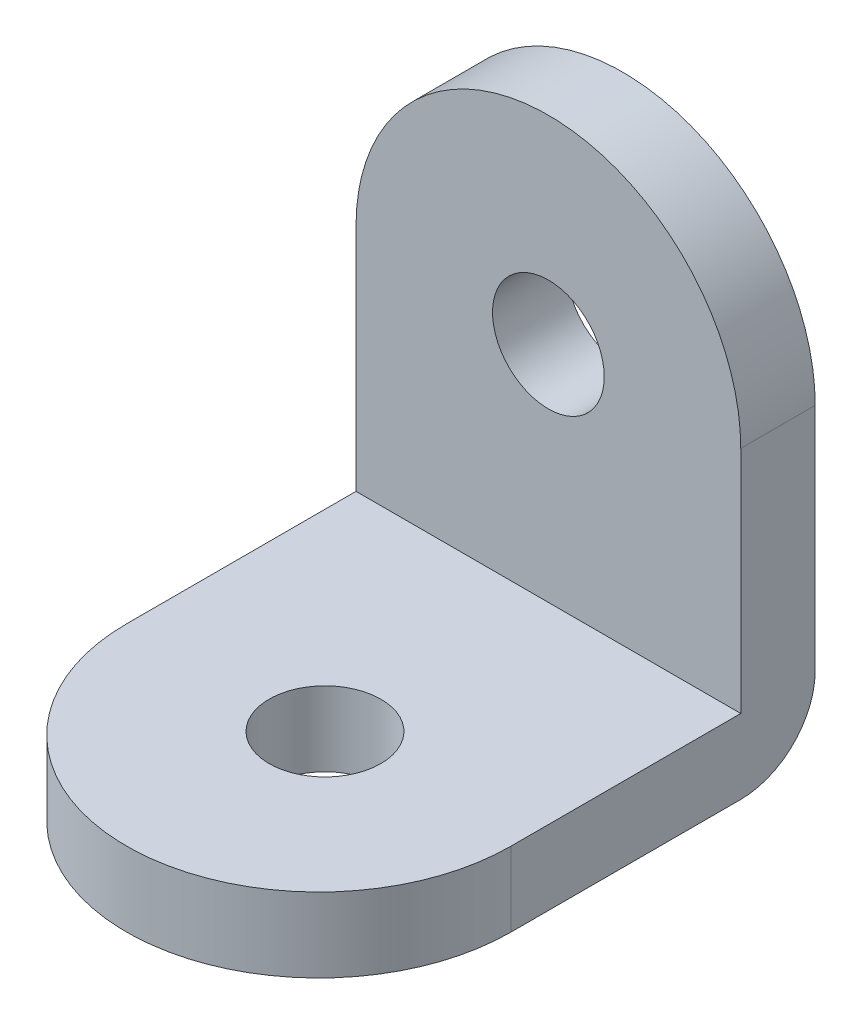
ISO-10303-21;
HEADER;
FILE_DESCRIPTION(('STEP AP214'),'2;1');
FILE_NAME('part.step','',(''),(''),'','','');
FILE_SCHEMA(('AUTOMOTIVE_DESIGN { 1 0 10303 214 1 1 1 1 }'));
ENDSEC;
DATA;
#1=APPLICATION_CONTEXT('core data for automotive mechanical design processes');
#2=APPLICATION_PROTOCOL_DEFINITION('international standard','automotive_design',2000,#1);
#3=PRODUCT_CONTEXT('',#1,'mechanical');
#4=PRODUCT('Part','Part','',(#3));
#5=PRODUCT_RELATED_PRODUCT_CATEGORY('part','',(#4));
#6=PRODUCT_DEFINITION_FORMATION('','',#4);
#7=PRODUCT_DEFINITION_CONTEXT('part definition',#1,'design');
#8=PRODUCT_DEFINITION('design','',#6,#7);
#9=PRODUCT_DEFINITION_SHAPE('','',#8);
#10=(LENGTH_UNIT() NAMED_UNIT(*) SI_UNIT(.MILLI.,.METRE.));
#11=(NAMED_UNIT(*) PLANE_ANGLE_UNIT() SI_UNIT($,.RADIAN.));
#12=(NAMED_UNIT(*) SI_UNIT($,.STERADIAN.) SOLID_ANGLE_UNIT());
#13=UNCERTAINTY_MEASURE_WITH_UNIT(LENGTH_MEASURE(1.E-05),#10,'distance_accuracy_value','');
#14=(GEOMETRIC_REPRESENTATION_CONTEXT(3) GLOBAL_UNCERTAINTY_ASSIGNED_CONTEXT((#13)) GLOBAL_UNIT_ASSIGNED_CONTEXT((#10,
#11,#12)) REPRESENTATION_CONTEXT('',''));
#15=CARTESIAN_POINT('',(0.,0.,0.));
#16=DIRECTION('',(0.,0.,1.));
#17=DIRECTION('',(1.,0.,0.));
#18=AXIS2_PLACEMENT_3D('',#15,#16,#17);
#19=CARTESIAN_POINT('',(0.,6.125,3.));
#20=DIRECTION('',(0.,0.,-1.));
#21=DIRECTION('',(-1.,0.,0.));
#22=AXIS2_PLACEMENT_3D('',#19,#20,#21);
#23=PLANE('',#22);
#24=DIRECTION('',(0.,-1.,0.));
#25=VECTOR('',#24,1.);
#26=CARTESIAN_POINT('',(-7.75,6.125,3.));
#27=LINE('',#26,#25);
#28=CARTESIAN_POINT('',(-7.75,6.125,3.));
#29=VERTEX_POINT('',#28);
#30=CARTESIAN_POINT('',(-7.75,-3.125,3.));
#31=VERTEX_POINT('',#30);
#32=EDGE_CURVE('E112',#29,#31,#27,.T.);
#33=ORIENTED_EDGE('',*,*,#32,.T.);
#34=DIRECTION('',(1.,0.,0.));
#35=VECTOR('',#34,1.);
#36=CARTESIAN_POINT('',(0.,-3.12500000000001,3.));
#37=LINE('',#36,#35);
#38=CARTESIAN_POINT('',(7.75,-3.125,3.));
#39=VERTEX_POINT('',#38);
#40=EDGE_CURVE('E129',#31,#39,#37,.T.);
#41=ORIENTED_EDGE('',*,*,#40,.T.);
#42=DIRECTION('',(0.,1.,0.));
#43=VECTOR('',#42,1.);
#44=CARTESIAN_POINT('',(7.75,6.125,3.));
#45=LINE('',#44,#43);
#46=CARTESIAN_POINT('',(7.75,6.125,3.));
#47=VERTEX_POINT('',#46);
#48=EDGE_CURVE('E146',#39,#47,#45,.T.);
#49=ORIENTED_EDGE('',*,*,#48,.T.);
#50=CARTESIAN_POINT('',(0.,6.125,3.));
#51=DIRECTION('',(0.,0.,1.));
#52=DIRECTION('',(-1.,0.,0.));
#53=AXIS2_PLACEMENT_3D('',#50,#51,#52);
#54=CIRCLE('',#53,7.75);
#55=EDGE_CURVE('E149',#47,#29,#54,.T.);
#56=ORIENTED_EDGE('',*,*,#55,.T.);
#57=EDGE_LOOP('',(#33,#41,#49,#56));
#58=FACE_BOUND('',#57,.T.);
#59=CARTESIAN_POINT('',(0.,5.875,3.));
#60=DIRECTION('',(0.,0.,1.));
#61=DIRECTION('',(1.,0.,0.));
#62=AXIS2_PLACEMENT_3D('',#59,#60,#61);
#63=CIRCLE('',#62,2.25);
#64=CARTESIAN_POINT('',(2.25,5.875,3.));
#65=VERTEX_POINT('',#64);
#66=EDGE_CURVE('E138',#65,#65,#63,.T.);
#67=ORIENTED_EDGE('',*,*,#66,.F.);
#68=EDGE_LOOP('',(#67));
#69=FACE_BOUND('',#68,.T.);
#70=ADVANCED_FACE('F41',(#58,#69),#23,.F.);
#71=CARTESIAN_POINT('',(0.,6.125,0.));
#72=DIRECTION('',(0.,0.,-1.));
#73=DIRECTION('',(-1.,0.,0.));
#74=AXIS2_PLACEMENT_3D('',#71,#72,#73);
#75=PLANE('',#74);
#76=DIRECTION('',(0.,1.,0.));
#77=VECTOR('',#76,1.);
#78=CARTESIAN_POINT('',(7.75,6.125,0.));
#79=LINE('',#78,#77);
#80=CARTESIAN_POINT('',(7.75,-3.12500000000001,0.));
#81=VERTEX_POINT('',#80);
#82=CARTESIAN_POINT('',(7.75,6.125,0.));
#83=VERTEX_POINT('',#82);
#84=EDGE_CURVE('E142',#81,#83,#79,.T.);
#85=ORIENTED_EDGE('',*,*,#84,.F.);
#86=DIRECTION('',(1.,0.,0.));
#87=VECTOR('',#86,1.);
#88=CARTESIAN_POINT('',(-7.75,-3.125,0.));
#89=LINE('',#88,#87);
#90=CARTESIAN_POINT('',(-7.75,-3.125,0.));
#91=VERTEX_POINT('',#90);
#92=EDGE_CURVE('E50',#81,#91,#89,.F.);
#93=ORIENTED_EDGE('',*,*,#92,.T.);
#94=DIRECTION('',(0.,-1.,0.));
#95=VECTOR('',#94,1.);
#96=CARTESIAN_POINT('',(-7.75,6.125,0.));
#97=LINE('',#96,#95);
#98=CARTESIAN_POINT('',(-7.75,6.125,0.));
#99=VERTEX_POINT('',#98);
#100=EDGE_CURVE('E150',#99,#91,#97,.T.);
#101=ORIENTED_EDGE('',*,*,#100,.F.);
#102=CARTESIAN_POINT('',(0.,6.125,0.));
#103=DIRECTION('',(0.,0.,1.));
#104=DIRECTION('',(-1.,0.,0.));
#105=AXIS2_PLACEMENT_3D('',#102,#103,#104);
#106=CIRCLE('',#105,7.75);
#107=EDGE_CURVE('E157',#83,#99,#106,.T.);
#108=ORIENTED_EDGE('',*,*,#107,.F.);
#109=EDGE_LOOP('',(#85,#93,#101,#108));
#110=FACE_BOUND('',#109,.T.);
#111=CARTESIAN_POINT('',(0.,5.875,0.));
#112=DIRECTION('',(0.,0.,1.));
#113=DIRECTION('',(1.,0.,0.));
#114=AXIS2_PLACEMENT_3D('',#111,#112,#113);
#115=CIRCLE('',#114,2.25);
#116=CARTESIAN_POINT('',(2.25,5.875,0.));
#117=VERTEX_POINT('',#116);
#118=EDGE_CURVE('E133',#117,#117,#115,.T.);
#119=ORIENTED_EDGE('',*,*,#118,.T.);
#120=EDGE_LOOP('',(#119));
#121=FACE_BOUND('',#120,.T.);
#122=ADVANCED_FACE('F182',(#110,#121),#75,.T.);
#123=CARTESIAN_POINT('',(7.75,6.125,3.));
#124=DIRECTION('',(-1.,0.,0.));
#125=DIRECTION('',(0.,-1.,0.));
#126=AXIS2_PLACEMENT_3D('',#123,#124,#125);
#127=PLANE('',#126);
#128=DIRECTION('',(0.,0.,-1.));
#129=VECTOR('',#128,1.);
#130=CARTESIAN_POINT('',(7.75,-6.125,3.));
#131=LINE('',#130,#129);
#132=CARTESIAN_POINT('',(7.75,-6.12500000000004,12.25));
#133=VERTEX_POINT('',#132);
#134=CARTESIAN_POINT('',(7.75,-6.125,3.));
#135=VERTEX_POINT('',#134);
#136=EDGE_CURVE('E100',#133,#135,#131,.T.);
#137=ORIENTED_EDGE('',*,*,#136,.T.);
#138=CARTESIAN_POINT('',(7.75,-3.125,3.));
#139=DIRECTION('',(-1.,0.,0.));
#140=DIRECTION('',(0.,-1.,0.));
#141=AXIS2_PLACEMENT_3D('',#138,#139,#140);
#142=CIRCLE('',#141,3.);
#143=EDGE_CURVE('E64',#135,#81,#142,.F.);
#144=ORIENTED_EDGE('',*,*,#143,.T.);
#145=ORIENTED_EDGE('',*,*,#84,.T.);
#146=DIRECTION('',(0.,0.,-1.));
#147=VECTOR('',#146,1.);
#148=CARTESIAN_POINT('',(7.75,6.125,3.));
#149=LINE('',#148,#147);
#150=EDGE_CURVE('E168',#47,#83,#149,.T.);
#151=ORIENTED_EDGE('',*,*,#150,.F.);
#152=ORIENTED_EDGE('',*,*,#48,.F.);
#153=DIRECTION('',(0.,0.,1.));
#154=VECTOR('',#153,1.);
#155=CARTESIAN_POINT('',(7.75,-3.12500000000004,12.25));
#156=LINE('',#155,#154);
#157=CARTESIAN_POINT('',(7.75,-3.12500000000004,12.25));
#158=VERTEX_POINT('',#157);
#159=EDGE_CURVE('E126',#39,#158,#156,.T.);
#160=ORIENTED_EDGE('',*,*,#159,.T.);
#161=DIRECTION('',(0.,1.,0.));
#162=VECTOR('',#161,1.);
#163=CARTESIAN_POINT('',(7.75,-6.12500000000004,12.25));
#164=LINE('',#163,#162);
#165=EDGE_CURVE('E117',#133,#158,#164,.T.);
#166=ORIENTED_EDGE('',*,*,#165,.F.);
#167=EDGE_LOOP('',(#137,#144,#145,#151,#152,#160,#166));
#168=FACE_BOUND('',#167,.T.);
#169=ADVANCED_FACE('F123',(#168),#127,.F.);
#170=CARTESIAN_POINT('',(0.,6.125,3.));
#171=DIRECTION('',(0.,0.,-1.));
#172=DIRECTION('',(-1.,0.,0.));
#173=AXIS2_PLACEMENT_3D('',#170,#171,#172);
#174=CYLINDRICAL_SURFACE('',#173,7.75);
#175=ORIENTED_EDGE('',*,*,#107,.T.);
#176=DIRECTION('',(0.,0.,-1.));
#177=VECTOR('',#176,1.);
#178=CARTESIAN_POINT('',(-7.75,6.125,3.));
#179=LINE('',#178,#177);
#180=EDGE_CURVE('E164',#29,#99,#179,.T.);
#181=ORIENTED_EDGE('',*,*,#180,.F.);
#182=ORIENTED_EDGE('',*,*,#55,.F.);
#183=ORIENTED_EDGE('',*,*,#150,.T.);
#184=EDGE_LOOP('',(#175,#181,#182,#183));
#185=FACE_BOUND('',#184,.T.);
#186=ADVANCED_FACE('F179',(#185),#174,.T.);
#187=CARTESIAN_POINT('',(-7.75,6.125,3.));
#188=DIRECTION('',(1.,0.,0.));
#189=DIRECTION('',(0.,1.,0.));
#190=AXIS2_PLACEMENT_3D('',#187,#188,#189);
#191=PLANE('',#190);
#192=ORIENTED_EDGE('',*,*,#100,.T.);
#193=CARTESIAN_POINT('',(-7.75,-3.125,3.));
#194=DIRECTION('',(1.,0.,0.));
#195=DIRECTION('',(0.,1.,0.));
#196=AXIS2_PLACEMENT_3D('',#193,#194,#195);
#197=CIRCLE('',#196,3.);
#198=CARTESIAN_POINT('',(-7.75,-6.125,3.));
#199=VERTEX_POINT('',#198);
#200=EDGE_CURVE('E11',#91,#199,#197,.F.);
#201=ORIENTED_EDGE('',*,*,#200,.T.);
#202=DIRECTION('',(0.,0.,-1.));
#203=VECTOR('',#202,1.);
#204=CARTESIAN_POINT('',(-7.75,-6.125,3.));
#205=LINE('',#204,#203);
#206=CARTESIAN_POINT('',(-7.75,-6.12500000000004,12.25));
#207=VERTEX_POINT('',#206);
#208=EDGE_CURVE('E111',#207,#199,#205,.T.);
#209=ORIENTED_EDGE('',*,*,#208,.F.);
#210=DIRECTION('',(0.,1.,0.));
#211=VECTOR('',#210,1.);
#212=CARTESIAN_POINT('',(-7.75,-6.12500000000004,12.25));
#213=LINE('',#212,#211);
#214=CARTESIAN_POINT('',(-7.75,-3.12500000000004,12.25));
#215=VERTEX_POINT('',#214);
#216=EDGE_CURVE('E119',#207,#215,#213,.T.);
#217=ORIENTED_EDGE('',*,*,#216,.T.);
#218=DIRECTION('',(0.,0.,-1.));
#219=VECTOR('',#218,1.);
#220=CARTESIAN_POINT('',(-7.75,-3.12500000000004,12.25));
#221=LINE('',#220,#219);
#222=EDGE_CURVE('E121',#215,#31,#221,.T.);
#223=ORIENTED_EDGE('',*,*,#222,.T.);
#224=ORIENTED_EDGE('',*,*,#32,.F.);
#225=ORIENTED_EDGE('',*,*,#180,.T.);
#226=EDGE_LOOP('',(#192,#201,#209,#217,#223,#224,#225));
#227=FACE_BOUND('',#226,.T.);
#228=ADVANCED_FACE('F186',(#227),#191,.F.);
#229=CARTESIAN_POINT('',(-7.75,-6.125,3.));
#230=DIRECTION('',(0.,1.,0.));
#231=DIRECTION('',(-1.,0.,0.));
#232=AXIS2_PLACEMENT_3D('',#229,#230,#231);
#233=PLANE('',#232);
#234=ORIENTED_EDGE('',*,*,#208,.T.);
#235=DIRECTION('',(1.,0.,0.));
#236=VECTOR('',#235,1.);
#237=CARTESIAN_POINT('',(7.75,-6.125,3.));
#238=LINE('',#237,#236);
#239=EDGE_CURVE('E108',#199,#135,#238,.T.);
#240=ORIENTED_EDGE('',*,*,#239,.T.);
#241=ORIENTED_EDGE('',*,*,#136,.F.);
#242=CARTESIAN_POINT('',(0.,-6.12500000000004,12.25));
#243=DIRECTION('',(0.,-1.,0.));
#244=DIRECTION('',(-1.,0.,0.));
#245=AXIS2_PLACEMENT_3D('',#242,#243,#244);
#246=CIRCLE('',#245,7.75);
#247=EDGE_CURVE('E105',#133,#207,#246,.T.);
#248=ORIENTED_EDGE('',*,*,#247,.T.);
#249=EDGE_LOOP('',(#234,#240,#241,#248));
#250=FACE_BOUND('',#249,.T.);
#251=CARTESIAN_POINT('',(0.,-6.12500000000004,12.));
#252=DIRECTION('',(0.,-1.,0.));
#253=DIRECTION('',(1.,0.,0.));
#254=AXIS2_PLACEMENT_3D('',#251,#252,#253);
#255=CIRCLE('',#254,2.25);
#256=CARTESIAN_POINT('',(2.25,-6.12500000000004,12.));
#257=VERTEX_POINT('',#256);
#258=EDGE_CURVE('E305',#257,#257,#255,.T.);
#259=ORIENTED_EDGE('',*,*,#258,.F.);
#260=EDGE_LOOP('',(#259));
#261=FACE_BOUND('',#260,.T.);
#262=ADVANCED_FACE('F103',(#250,#261),#233,.F.);
#263=CARTESIAN_POINT('',(0.,5.875,3.));
#264=DIRECTION('',(0.,0.,-1.));
#265=DIRECTION('',(-1.,0.,0.));
#266=AXIS2_PLACEMENT_3D('',#263,#264,#265);
#267=CYLINDRICAL_SURFACE('',#266,2.25);
#268=ORIENTED_EDGE('',*,*,#66,.T.);
#269=EDGE_LOOP('',(#268));
#270=FACE_BOUND('',#269,.T.);
#271=ORIENTED_EDGE('',*,*,#118,.F.);
#272=EDGE_LOOP('',(#271));
#273=FACE_BOUND('',#272,.T.);
#274=ADVANCED_FACE('F205',(#270,#273),#267,.F.);
#275=CARTESIAN_POINT('',(0.,-3.12500000000004,12.25));
#276=DIRECTION('',(0.,1.,0.));
#277=DIRECTION('',(-1.,0.,0.));
#278=AXIS2_PLACEMENT_3D('',#275,#276,#277);
#279=PLANE('',#278);
#280=CARTESIAN_POINT('',(0.,-3.12500000000004,12.));
#281=DIRECTION('',(0.,-1.,0.));
#282=DIRECTION('',(1.,0.,0.));
#283=AXIS2_PLACEMENT_3D('',#280,#281,#282);
#284=CIRCLE('',#283,2.25);
#285=CARTESIAN_POINT('',(2.25,-3.12500000000004,12.));
#286=VERTEX_POINT('',#285);
#287=EDGE_CURVE('E295',#286,#286,#284,.T.);
#288=ORIENTED_EDGE('',*,*,#287,.T.);
#289=EDGE_LOOP('',(#288));
#290=FACE_BOUND('',#289,.T.);
#291=ORIENTED_EDGE('',*,*,#40,.F.);
#292=ORIENTED_EDGE('',*,*,#222,.F.);
#293=CARTESIAN_POINT('',(0.,-3.12500000000004,12.25));
#294=DIRECTION('',(0.,-1.,0.));
#295=DIRECTION('',(-1.,0.,0.));
#296=AXIS2_PLACEMENT_3D('',#293,#294,#295);
#297=CIRCLE('',#296,7.75);
#298=EDGE_CURVE('E300',#158,#215,#297,.T.);
#299=ORIENTED_EDGE('',*,*,#298,.F.);
#300=ORIENTED_EDGE('',*,*,#159,.F.);
#301=EDGE_LOOP('',(#291,#292,#299,#300));
#302=FACE_BOUND('',#301,.T.);
#303=ADVANCED_FACE('F236',(#290,#302),#279,.T.);
#304=CARTESIAN_POINT('',(0.,-6.12500000000004,12.25));
#305=DIRECTION('',(0.,1.,0.));
#306=DIRECTION('',(0.,0.,1.));
#307=AXIS2_PLACEMENT_3D('',#304,#305,#306);
#308=CYLINDRICAL_SURFACE('',#307,7.75);
#309=ORIENTED_EDGE('',*,*,#298,.T.);
#310=ORIENTED_EDGE('',*,*,#216,.F.);
#311=ORIENTED_EDGE('',*,*,#247,.F.);
#312=ORIENTED_EDGE('',*,*,#165,.T.);
#313=EDGE_LOOP('',(#309,#310,#311,#312));
#314=FACE_BOUND('',#313,.T.);
#315=ADVANCED_FACE('F116',(#314),#308,.T.);
#316=CARTESIAN_POINT('',(0.,-6.12500000000004,12.));
#317=DIRECTION('',(0.,1.,0.));
#318=DIRECTION('',(0.,0.,1.));
#319=AXIS2_PLACEMENT_3D('',#316,#317,#318);
#320=CYLINDRICAL_SURFACE('',#319,2.25);
#321=ORIENTED_EDGE('',*,*,#258,.T.);
#322=EDGE_LOOP('',(#321));
#323=FACE_BOUND('',#322,.T.);
#324=ORIENTED_EDGE('',*,*,#287,.F.);
#325=EDGE_LOOP('',(#324));
#326=FACE_BOUND('',#325,.T.);
#327=ADVANCED_FACE('F190',(#323,#326),#320,.F.);
#328=CARTESIAN_POINT('',(-7.75,-3.125,3.));
#329=DIRECTION('',(-1.,0.,0.));
#330=DIRECTION('',(0.,-1.,0.));
#331=AXIS2_PLACEMENT_3D('',#328,#329,#330);
#332=CYLINDRICAL_SURFACE('',#331,3.);
#333=ORIENTED_EDGE('',*,*,#200,.F.);
#334=ORIENTED_EDGE('',*,*,#92,.F.);
#335=ORIENTED_EDGE('',*,*,#143,.F.);
#336=ORIENTED_EDGE('',*,*,#239,.F.);
#337=EDGE_LOOP('',(#333,#334,#335,#336));
#338=FACE_BOUND('',#337,.T.);
#339=ADVANCED_FACE('F43',(#338),#332,.T.);
#340=CLOSED_SHELL('',(#70,#122,#169,#186,#228,#262,#274,#303,#315,#327,#339));
#341=MANIFOLD_SOLID_BREP('B2',#340);
#342=ADVANCED_BREP_SHAPE_REPRESENTATION('',(#18,#341),#14);
#343=SHAPE_DEFINITION_REPRESENTATION(#9,#342);
ENDSEC;
END-ISO-10303-21;
